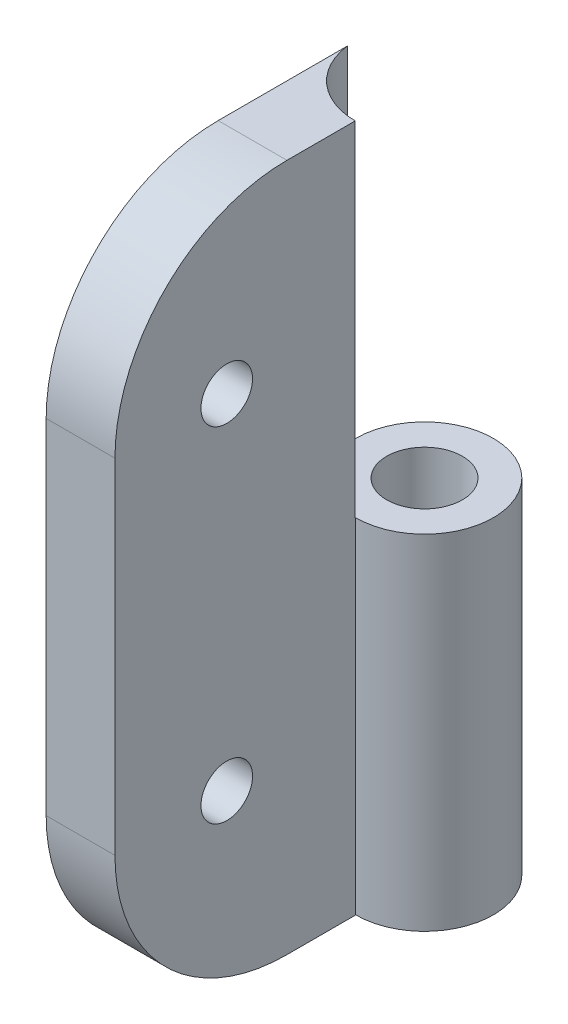
ISO-10303-21;
HEADER;
FILE_DESCRIPTION(('STEP AP214'),'2;1');
FILE_NAME('part.step','',(''),(''),'','','');
FILE_SCHEMA(('AUTOMOTIVE_DESIGN { 1 0 10303 214 1 1 1 1 }'));
ENDSEC;
DATA;
#1=APPLICATION_CONTEXT('core data for automotive mechanical design processes');
#2=APPLICATION_PROTOCOL_DEFINITION('international standard','automotive_design',2000,#1);
#3=PRODUCT_CONTEXT('',#1,'mechanical');
#4=PRODUCT('Part','Part','',(#3));
#5=PRODUCT_RELATED_PRODUCT_CATEGORY('part','',(#4));
#6=PRODUCT_DEFINITION_FORMATION('','',#4);
#7=PRODUCT_DEFINITION_CONTEXT('part definition',#1,'design');
#8=PRODUCT_DEFINITION('design','',#6,#7);
#9=PRODUCT_DEFINITION_SHAPE('','',#8);
#10=(LENGTH_UNIT() NAMED_UNIT(*) SI_UNIT(.MILLI.,.METRE.));
#11=(NAMED_UNIT(*) PLANE_ANGLE_UNIT() SI_UNIT($,.RADIAN.));
#12=(NAMED_UNIT(*) SI_UNIT($,.STERADIAN.) SOLID_ANGLE_UNIT());
#13=UNCERTAINTY_MEASURE_WITH_UNIT(LENGTH_MEASURE(1.E-05),#10,'distance_accuracy_value','');
#14=(GEOMETRIC_REPRESENTATION_CONTEXT(3) GLOBAL_UNCERTAINTY_ASSIGNED_CONTEXT((#13)) GLOBAL_UNIT_ASSIGNED_CONTEXT((#10,
#11,#12)) REPRESENTATION_CONTEXT('',''));
#15=CARTESIAN_POINT('',(0.,0.,0.));
#16=DIRECTION('',(0.,0.,1.));
#17=DIRECTION('',(1.,0.,0.));
#18=AXIS2_PLACEMENT_3D('',#15,#16,#17);
#19=CARTESIAN_POINT('',(4.,0.,0.));
#20=DIRECTION('',(0.,1.,0.));
#21=DIRECTION('',(0.,0.,1.));
#22=AXIS2_PLACEMENT_3D('',#19,#20,#21);
#23=CYLINDRICAL_SURFACE('',#22,4.);
#24=DIRECTION('',(0.,1.,0.));
#25=VECTOR('',#24,1.);
#26=CARTESIAN_POINT('',(0.,0.,0.));
#27=LINE('',#26,#25);
#28=CARTESIAN_POINT('',(0.,0.,0.));
#29=VERTEX_POINT('',#28);
#30=CARTESIAN_POINT('',(0.,20.,0.));
#31=VERTEX_POINT('',#30);
#32=EDGE_CURVE('E133',#29,#31,#27,.T.);
#33=ORIENTED_EDGE('',*,*,#32,.T.);
#34=CARTESIAN_POINT('',(4.,20.,0.));
#35=DIRECTION('',(0.,1.,0.));
#36=DIRECTION('',(0.,0.,1.));
#37=AXIS2_PLACEMENT_3D('',#34,#35,#36);
#38=CIRCLE('',#37,4.);
#39=CARTESIAN_POINT('',(4.,20.,4.));
#40=VERTEX_POINT('',#39);
#41=EDGE_CURVE('E149',#31,#40,#38,.F.);
#42=ORIENTED_EDGE('',*,*,#41,.T.);
#43=DIRECTION('',(0.,1.,0.));
#44=VECTOR('',#43,1.);
#45=CARTESIAN_POINT('',(4.,0.,4.));
#46=LINE('',#45,#44);
#47=CARTESIAN_POINT('',(4.,0.,4.));
#48=VERTEX_POINT('',#47);
#49=EDGE_CURVE('E131',#48,#40,#46,.T.);
#50=ORIENTED_EDGE('',*,*,#49,.F.);
#51=CARTESIAN_POINT('',(4.,0.,0.));
#52=DIRECTION('',(0.,1.,0.));
#53=DIRECTION('',(0.,0.,1.));
#54=AXIS2_PLACEMENT_3D('',#51,#52,#53);
#55=CIRCLE('',#54,4.);
#56=EDGE_CURVE('E123',#48,#29,#55,.T.);
#57=ORIENTED_EDGE('',*,*,#56,.T.);
#58=EDGE_LOOP('',(#33,#42,#50,#57));
#59=FACE_BOUND('',#58,.T.);
#60=ADVANCED_FACE('F33',(#59),#23,.T.);
#61=CARTESIAN_POINT('',(4.,0.,0.));
#62=DIRECTION('',(0.,1.,0.));
#63=DIRECTION('',(0.,0.,1.));
#64=AXIS2_PLACEMENT_3D('',#61,#62,#63);
#65=CYLINDRICAL_SURFACE('',#64,2.2);
#66=CARTESIAN_POINT('',(4.,0.,0.));
#67=DIRECTION('',(0.,1.,0.));
#68=DIRECTION('',(0.,0.,1.));
#69=AXIS2_PLACEMENT_3D('',#66,#67,#68);
#70=CIRCLE('',#69,2.2);
#71=CARTESIAN_POINT('',(4.,0.,2.2));
#72=VERTEX_POINT('',#71);
#73=EDGE_CURVE('E120',#72,#72,#70,.T.);
#74=ORIENTED_EDGE('',*,*,#73,.F.);
#75=EDGE_LOOP('',(#74));
#76=FACE_BOUND('',#75,.T.);
#77=CARTESIAN_POINT('',(4.,20.,0.));
#78=DIRECTION('',(0.,1.,0.));
#79=DIRECTION('',(0.,0.,1.));
#80=AXIS2_PLACEMENT_3D('',#77,#78,#79);
#81=CIRCLE('',#80,2.2);
#82=CARTESIAN_POINT('',(4.,20.,2.2));
#83=VERTEX_POINT('',#82);
#84=EDGE_CURVE('E146',#83,#83,#81,.F.);
#85=ORIENTED_EDGE('',*,*,#84,.F.);
#86=EDGE_LOOP('',(#85));
#87=FACE_BOUND('',#86,.T.);
#88=ADVANCED_FACE('F210',(#76,#87),#65,.F.);
#89=CARTESIAN_POINT('',(4.,0.,18.));
#90=DIRECTION('',(-1.,0.,0.));
#91=DIRECTION('',(0.,0.,1.));
#92=AXIS2_PLACEMENT_3D('',#89,#90,#91);
#93=PLANE('',#92);
#94=CARTESIAN_POINT('',(4.,30.,11.5));
#95=DIRECTION('',(1.,0.,0.));
#96=DIRECTION('',(0.,0.,-1.));
#97=AXIS2_PLACEMENT_3D('',#94,#95,#96);
#98=CIRCLE('',#97,1.5);
#99=CARTESIAN_POINT('',(4.,30.,10.));
#100=VERTEX_POINT('',#99);
#101=EDGE_CURVE('E193',#100,#100,#98,.T.);
#102=ORIENTED_EDGE('',*,*,#101,.F.);
#103=EDGE_LOOP('',(#102));
#104=FACE_BOUND('',#103,.T.);
#105=CARTESIAN_POINT('',(4.,10.,11.5));
#106=DIRECTION('',(1.,0.,0.));
#107=DIRECTION('',(0.,0.,-1.));
#108=AXIS2_PLACEMENT_3D('',#105,#106,#107);
#109=CIRCLE('',#108,1.5);
#110=CARTESIAN_POINT('',(4.,10.,10.));
#111=VERTEX_POINT('',#110);
#112=EDGE_CURVE('E187',#111,#111,#109,.T.);
#113=ORIENTED_EDGE('',*,*,#112,.F.);
#114=EDGE_LOOP('',(#113));
#115=FACE_BOUND('',#114,.T.);
#116=DIRECTION('',(0.,1.,0.));
#117=VECTOR('',#116,1.);
#118=CARTESIAN_POINT('',(4.,0.,18.));
#119=LINE('',#118,#117);
#120=CARTESIAN_POINT('',(4.,10.,18.));
#121=VERTEX_POINT('',#120);
#122=CARTESIAN_POINT('',(4.,30.,18.));
#123=VERTEX_POINT('',#122);
#124=EDGE_CURVE('E134',#121,#123,#119,.T.);
#125=ORIENTED_EDGE('',*,*,#124,.F.);
#126=CARTESIAN_POINT('',(4.,10.,8.));
#127=DIRECTION('',(-1.,0.,0.));
#128=DIRECTION('',(0.,0.,1.));
#129=AXIS2_PLACEMENT_3D('',#126,#127,#128);
#130=CIRCLE('',#129,10.);
#131=CARTESIAN_POINT('',(4.,0.,8.));
#132=VERTEX_POINT('',#131);
#133=EDGE_CURVE('E41',#121,#132,#130,.F.);
#134=ORIENTED_EDGE('',*,*,#133,.T.);
#135=DIRECTION('',(0.,0.,-1.));
#136=VECTOR('',#135,1.);
#137=CARTESIAN_POINT('',(4.,0.,18.));
#138=LINE('',#137,#136);
#139=EDGE_CURVE('E139',#132,#48,#138,.T.);
#140=ORIENTED_EDGE('',*,*,#139,.T.);
#141=ORIENTED_EDGE('',*,*,#49,.T.);
#142=DIRECTION('',(0.,0.,-1.));
#143=VECTOR('',#142,1.);
#144=CARTESIAN_POINT('',(4.,20.,18.));
#145=LINE('',#144,#143);
#146=CARTESIAN_POINT('',(4.,20.,4.03));
#147=VERTEX_POINT('',#146);
#148=EDGE_CURVE('E119',#147,#40,#145,.T.);
#149=ORIENTED_EDGE('',*,*,#148,.F.);
#150=DIRECTION('',(0.,1.,0.));
#151=VECTOR('',#150,1.);
#152=CARTESIAN_POINT('',(4.,20.,4.03));
#153=LINE('',#152,#151);
#154=CARTESIAN_POINT('',(4.,40.,4.03));
#155=VERTEX_POINT('',#154);
#156=EDGE_CURVE('E110',#147,#155,#153,.T.);
#157=ORIENTED_EDGE('',*,*,#156,.T.);
#158=DIRECTION('',(0.,0.,-1.));
#159=VECTOR('',#158,1.);
#160=CARTESIAN_POINT('',(4.,40.,18.));
#161=LINE('',#160,#159);
#162=CARTESIAN_POINT('',(4.,40.,8.));
#163=VERTEX_POINT('',#162);
#164=EDGE_CURVE('E97',#163,#155,#161,.T.);
#165=ORIENTED_EDGE('',*,*,#164,.F.);
#166=CARTESIAN_POINT('',(4.,30.,8.));
#167=DIRECTION('',(-1.,0.,0.));
#168=DIRECTION('',(0.,0.,1.));
#169=AXIS2_PLACEMENT_3D('',#166,#167,#168);
#170=CIRCLE('',#169,10.);
#171=EDGE_CURVE('E48',#163,#123,#170,.F.);
#172=ORIENTED_EDGE('',*,*,#171,.T.);
#173=EDGE_LOOP('',(#125,#134,#140,#141,#149,#157,#165,#172));
#174=FACE_BOUND('',#173,.T.);
#175=ADVANCED_FACE('F117',(#104,#115,#174),#93,.F.);
#176=CARTESIAN_POINT('',(0.,40.,18.));
#177=DIRECTION('',(0.,1.,0.));
#178=DIRECTION('',(0.,0.,1.));
#179=AXIS2_PLACEMENT_3D('',#176,#177,#178);
#180=PLANE('',#179);
#181=DIRECTION('',(0.,0.,-1.));
#182=VECTOR('',#181,1.);
#183=CARTESIAN_POINT('',(0.,40.,18.));
#184=LINE('',#183,#182);
#185=CARTESIAN_POINT('',(0.,40.,8.));
#186=VERTEX_POINT('',#185);
#187=CARTESIAN_POINT('',(0.,40.,0.490815647672335));
#188=VERTEX_POINT('',#187);
#189=EDGE_CURVE('E104',#186,#188,#184,.T.);
#190=ORIENTED_EDGE('',*,*,#189,.F.);
#191=DIRECTION('',(1.,0.,0.));
#192=VECTOR('',#191,1.);
#193=CARTESIAN_POINT('',(4.,40.,8.));
#194=LINE('',#193,#192);
#195=EDGE_CURVE('E11',#186,#163,#194,.T.);
#196=ORIENTED_EDGE('',*,*,#195,.T.);
#197=ORIENTED_EDGE('',*,*,#164,.T.);
#198=CARTESIAN_POINT('',(4.,40.,0.));
#199=DIRECTION('',(0.,1.,0.));
#200=DIRECTION('',(0.,0.,1.));
#201=AXIS2_PLACEMENT_3D('',#198,#199,#200);
#202=CIRCLE('',#201,4.03);
#203=EDGE_CURVE('E101',#188,#155,#202,.T.);
#204=ORIENTED_EDGE('',*,*,#203,.F.);
#205=EDGE_LOOP('',(#190,#196,#197,#204));
#206=FACE_BOUND('',#205,.T.);
#207=ADVANCED_FACE('F100',(#206),#180,.T.);
#208=CARTESIAN_POINT('',(0.,0.,18.));
#209=DIRECTION('',(-1.,0.,0.));
#210=DIRECTION('',(0.,0.,1.));
#211=AXIS2_PLACEMENT_3D('',#208,#209,#210);
#212=PLANE('',#211);
#213=CARTESIAN_POINT('',(0.,30.,11.5));
#214=DIRECTION('',(1.,0.,0.));
#215=DIRECTION('',(0.,0.,-1.));
#216=AXIS2_PLACEMENT_3D('',#213,#214,#215);
#217=CIRCLE('',#216,1.5);
#218=CARTESIAN_POINT('',(0.,30.,10.));
#219=VERTEX_POINT('',#218);
#220=EDGE_CURVE('E190',#219,#219,#217,.T.);
#221=ORIENTED_EDGE('',*,*,#220,.T.);
#222=EDGE_LOOP('',(#221));
#223=FACE_BOUND('',#222,.T.);
#224=CARTESIAN_POINT('',(0.,10.,11.5));
#225=DIRECTION('',(1.,0.,0.));
#226=DIRECTION('',(0.,0.,-1.));
#227=AXIS2_PLACEMENT_3D('',#224,#225,#226);
#228=CIRCLE('',#227,1.5);
#229=CARTESIAN_POINT('',(0.,10.,10.));
#230=VERTEX_POINT('',#229);
#231=EDGE_CURVE('E114',#230,#230,#228,.T.);
#232=ORIENTED_EDGE('',*,*,#231,.T.);
#233=EDGE_LOOP('',(#232));
#234=FACE_BOUND('',#233,.T.);
#235=DIRECTION('',(0.,0.,-1.));
#236=VECTOR('',#235,1.);
#237=CARTESIAN_POINT('',(0.,0.,18.));
#238=LINE('',#237,#236);
#239=CARTESIAN_POINT('',(0.,0.,8.));
#240=VERTEX_POINT('',#239);
#241=EDGE_CURVE('E143',#240,#29,#238,.T.);
#242=ORIENTED_EDGE('',*,*,#241,.F.);
#243=CARTESIAN_POINT('',(0.,10.,8.));
#244=DIRECTION('',(-1.,0.,0.));
#245=DIRECTION('',(0.,0.,1.));
#246=AXIS2_PLACEMENT_3D('',#243,#244,#245);
#247=CIRCLE('',#246,10.);
#248=CARTESIAN_POINT('',(0.,10.,18.));
#249=VERTEX_POINT('',#248);
#250=EDGE_CURVE('E156',#240,#249,#247,.T.);
#251=ORIENTED_EDGE('',*,*,#250,.T.);
#252=DIRECTION('',(0.,1.,0.));
#253=VECTOR('',#252,1.);
#254=CARTESIAN_POINT('',(0.,0.,18.));
#255=LINE('',#254,#253);
#256=CARTESIAN_POINT('',(0.,30.,18.));
#257=VERTEX_POINT('',#256);
#258=EDGE_CURVE('E136',#249,#257,#255,.T.);
#259=ORIENTED_EDGE('',*,*,#258,.T.);
#260=CARTESIAN_POINT('',(0.,30.,8.));
#261=DIRECTION('',(-1.,0.,0.));
#262=DIRECTION('',(0.,0.,1.));
#263=AXIS2_PLACEMENT_3D('',#260,#261,#262);
#264=CIRCLE('',#263,10.);
#265=EDGE_CURVE('E154',#257,#186,#264,.T.);
#266=ORIENTED_EDGE('',*,*,#265,.T.);
#267=ORIENTED_EDGE('',*,*,#189,.T.);
#268=DIRECTION('',(0.,1.,0.));
#269=VECTOR('',#268,1.);
#270=CARTESIAN_POINT('',(0.,20.,0.490815647672335));
#271=LINE('',#270,#269);
#272=CARTESIAN_POINT('',(0.,20.,0.490815647672335));
#273=VERTEX_POINT('',#272);
#274=EDGE_CURVE('E103',#273,#188,#271,.T.);
#275=ORIENTED_EDGE('',*,*,#274,.F.);
#276=DIRECTION('',(0.,0.,-1.));
#277=VECTOR('',#276,1.);
#278=CARTESIAN_POINT('',(0.,20.,18.));
#279=LINE('',#278,#277);
#280=EDGE_CURVE('E125',#273,#31,#279,.T.);
#281=ORIENTED_EDGE('',*,*,#280,.T.);
#282=ORIENTED_EDGE('',*,*,#32,.F.);
#283=EDGE_LOOP('',(#242,#251,#259,#266,#267,#275,#281,#282));
#284=FACE_BOUND('',#283,.T.);
#285=ADVANCED_FACE('F175',(#223,#234,#284),#212,.T.);
#286=CARTESIAN_POINT('',(4.,0.,18.));
#287=DIRECTION('',(0.,-1.,0.));
#288=DIRECTION('',(0.,0.,-1.));
#289=AXIS2_PLACEMENT_3D('',#286,#287,#288);
#290=PLANE('',#289);
#291=ORIENTED_EDGE('',*,*,#73,.T.);
#292=EDGE_LOOP('',(#291));
#293=FACE_BOUND('',#292,.T.);
#294=ORIENTED_EDGE('',*,*,#139,.F.);
#295=DIRECTION('',(-1.,0.,0.));
#296=VECTOR('',#295,1.);
#297=CARTESIAN_POINT('',(0.,0.,8.));
#298=LINE('',#297,#296);
#299=EDGE_CURVE('E151',#132,#240,#298,.T.);
#300=ORIENTED_EDGE('',*,*,#299,.T.);
#301=ORIENTED_EDGE('',*,*,#241,.T.);
#302=ORIENTED_EDGE('',*,*,#56,.F.);
#303=EDGE_LOOP('',(#294,#300,#301,#302));
#304=FACE_BOUND('',#303,.T.);
#305=ADVANCED_FACE('F170',(#293,#304),#290,.T.);
#306=CARTESIAN_POINT('',(4.,40.,18.));
#307=DIRECTION('',(0.,0.,-1.));
#308=DIRECTION('',(-1.,0.,0.));
#309=AXIS2_PLACEMENT_3D('',#306,#307,#308);
#310=PLANE('',#309);
#311=ORIENTED_EDGE('',*,*,#258,.F.);
#312=DIRECTION('',(-1.,0.,0.));
#313=VECTOR('',#312,1.);
#314=CARTESIAN_POINT('',(4.,10.,18.));
#315=LINE('',#314,#313);
#316=EDGE_CURVE('E160',#249,#121,#315,.F.);
#317=ORIENTED_EDGE('',*,*,#316,.T.);
#318=ORIENTED_EDGE('',*,*,#124,.T.);
#319=DIRECTION('',(1.,0.,0.));
#320=VECTOR('',#319,1.);
#321=CARTESIAN_POINT('',(0.,30.,18.));
#322=LINE('',#321,#320);
#323=EDGE_CURVE('E158',#123,#257,#322,.F.);
#324=ORIENTED_EDGE('',*,*,#323,.T.);
#325=EDGE_LOOP('',(#311,#317,#318,#324));
#326=FACE_BOUND('',#325,.T.);
#327=ADVANCED_FACE('F179',(#326),#310,.F.);
#328=CARTESIAN_POINT('',(4.,20.,0.));
#329=DIRECTION('',(0.,1.,0.));
#330=DIRECTION('',(0.,0.,1.));
#331=AXIS2_PLACEMENT_3D('',#328,#329,#330);
#332=CYLINDRICAL_SURFACE('',#331,4.03);
#333=CARTESIAN_POINT('',(4.,20.,0.));
#334=DIRECTION('',(0.,1.,0.));
#335=DIRECTION('',(0.,0.,1.));
#336=AXIS2_PLACEMENT_3D('',#333,#334,#335);
#337=CIRCLE('',#336,4.03);
#338=EDGE_CURVE('E113',#273,#147,#337,.T.);
#339=ORIENTED_EDGE('',*,*,#338,.F.);
#340=ORIENTED_EDGE('',*,*,#274,.T.);
#341=ORIENTED_EDGE('',*,*,#203,.T.);
#342=ORIENTED_EDGE('',*,*,#156,.F.);
#343=EDGE_LOOP('',(#339,#340,#341,#342));
#344=FACE_BOUND('',#343,.T.);
#345=ADVANCED_FACE('F109',(#344),#332,.F.);
#346=CARTESIAN_POINT('',(4.,20.,0.));
#347=DIRECTION('',(0.,1.,0.));
#348=DIRECTION('',(0.,0.,1.));
#349=AXIS2_PLACEMENT_3D('',#346,#347,#348);
#350=PLANE('',#349);
#351=ORIENTED_EDGE('',*,*,#84,.T.);
#352=EDGE_LOOP('',(#351));
#353=FACE_BOUND('',#352,.T.);
#354=ORIENTED_EDGE('',*,*,#148,.T.);
#355=ORIENTED_EDGE('',*,*,#41,.F.);
#356=ORIENTED_EDGE('',*,*,#280,.F.);
#357=ORIENTED_EDGE('',*,*,#338,.T.);
#358=EDGE_LOOP('',(#354,#355,#356,#357));
#359=FACE_BOUND('',#358,.T.);
#360=ADVANCED_FACE('F215',(#353,#359),#350,.T.);
#361=CARTESIAN_POINT('',(0.,10.,11.5));
#362=DIRECTION('',(1.,0.,0.));
#363=DIRECTION('',(0.,0.,-1.));
#364=AXIS2_PLACEMENT_3D('',#361,#362,#363);
#365=CYLINDRICAL_SURFACE('',#364,1.5);
#366=ORIENTED_EDGE('',*,*,#231,.F.);
#367=EDGE_LOOP('',(#366));
#368=FACE_BOUND('',#367,.T.);
#369=ORIENTED_EDGE('',*,*,#112,.T.);
#370=EDGE_LOOP('',(#369));
#371=FACE_BOUND('',#370,.T.);
#372=ADVANCED_FACE('F204',(#368,#371),#365,.F.);
#373=CARTESIAN_POINT('',(0.,30.,11.5));
#374=DIRECTION('',(1.,0.,0.));
#375=DIRECTION('',(0.,0.,-1.));
#376=AXIS2_PLACEMENT_3D('',#373,#374,#375);
#377=CYLINDRICAL_SURFACE('',#376,1.5);
#378=ORIENTED_EDGE('',*,*,#220,.F.);
#379=EDGE_LOOP('',(#378));
#380=FACE_BOUND('',#379,.T.);
#381=ORIENTED_EDGE('',*,*,#101,.T.);
#382=EDGE_LOOP('',(#381));
#383=FACE_BOUND('',#382,.T.);
#384=ADVANCED_FACE('F201',(#380,#383),#377,.F.);
#385=CARTESIAN_POINT('',(4.,10.,8.));
#386=DIRECTION('',(1.,0.,0.));
#387=DIRECTION('',(0.,0.,-1.));
#388=AXIS2_PLACEMENT_3D('',#385,#386,#387);
#389=CYLINDRICAL_SURFACE('',#388,10.);
#390=ORIENTED_EDGE('',*,*,#133,.F.);
#391=ORIENTED_EDGE('',*,*,#316,.F.);
#392=ORIENTED_EDGE('',*,*,#250,.F.);
#393=ORIENTED_EDGE('',*,*,#299,.F.);
#394=EDGE_LOOP('',(#390,#391,#392,#393));
#395=FACE_BOUND('',#394,.T.);
#396=ADVANCED_FACE('F172',(#395),#389,.T.);
#397=CARTESIAN_POINT('',(0.,30.,8.));
#398=DIRECTION('',(-1.,0.,0.));
#399=DIRECTION('',(0.,0.,1.));
#400=AXIS2_PLACEMENT_3D('',#397,#398,#399);
#401=CYLINDRICAL_SURFACE('',#400,10.);
#402=ORIENTED_EDGE('',*,*,#265,.F.);
#403=ORIENTED_EDGE('',*,*,#323,.F.);
#404=ORIENTED_EDGE('',*,*,#171,.F.);
#405=ORIENTED_EDGE('',*,*,#195,.F.);
#406=EDGE_LOOP('',(#402,#403,#404,#405));
#407=FACE_BOUND('',#406,.T.);
#408=ADVANCED_FACE('F35',(#407),#401,.T.);
#409=CLOSED_SHELL('',(#60,#88,#175,#207,#285,#305,#327,#345,#360,#372,#384,#396,#408));
#410=MANIFOLD_SOLID_BREP('B2',#409);
#411=ADVANCED_BREP_SHAPE_REPRESENTATION('',(#18,#410),#14);
#412=SHAPE_DEFINITION_REPRESENTATION(#9,#411);
ENDSEC;
END-ISO-10303-21;
